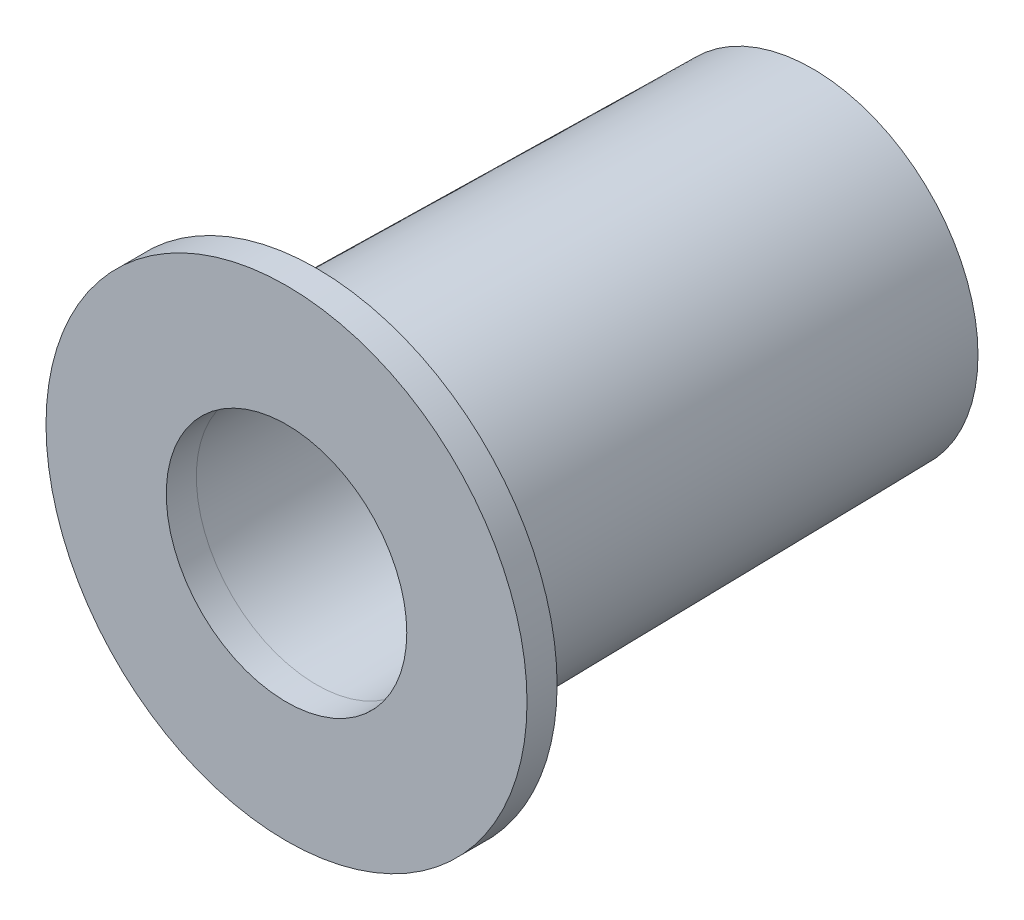
ISO-10303-21;
HEADER;
FILE_DESCRIPTION(('STEP AP214'),'2;1');
FILE_NAME('part.step','',(''),(''),'','','');
FILE_SCHEMA(('AUTOMOTIVE_DESIGN { 1 0 10303 214 1 1 1 1 }'));
ENDSEC;
DATA;
#1=APPLICATION_CONTEXT('core data for automotive mechanical design processes');
#2=APPLICATION_PROTOCOL_DEFINITION('international standard','automotive_design',2000,#1);
#3=PRODUCT_CONTEXT('',#1,'mechanical');
#4=PRODUCT('Part','Part','',(#3));
#5=PRODUCT_RELATED_PRODUCT_CATEGORY('part','',(#4));
#6=PRODUCT_DEFINITION_FORMATION('','',#4);
#7=PRODUCT_DEFINITION_CONTEXT('part definition',#1,'design');
#8=PRODUCT_DEFINITION('design','',#6,#7);
#9=PRODUCT_DEFINITION_SHAPE('','',#8);
#10=(LENGTH_UNIT() NAMED_UNIT(*) SI_UNIT(.MILLI.,.METRE.));
#11=(NAMED_UNIT(*) PLANE_ANGLE_UNIT() SI_UNIT($,.RADIAN.));
#12=(NAMED_UNIT(*) SI_UNIT($,.STERADIAN.) SOLID_ANGLE_UNIT());
#13=UNCERTAINTY_MEASURE_WITH_UNIT(LENGTH_MEASURE(1.E-05),#10,'distance_accuracy_value','');
#14=(GEOMETRIC_REPRESENTATION_CONTEXT(3) GLOBAL_UNCERTAINTY_ASSIGNED_CONTEXT((#13)) GLOBAL_UNIT_ASSIGNED_CONTEXT((#10,
#11,#12)) REPRESENTATION_CONTEXT('',''));
#15=CARTESIAN_POINT('',(0.,0.,0.));
#16=DIRECTION('',(0.,0.,1.));
#17=DIRECTION('',(1.,0.,0.));
#18=AXIS2_PLACEMENT_3D('',#15,#16,#17);
#19=CARTESIAN_POINT('',(0.,0.,0.));
#20=DIRECTION('',(0.,0.,1.));
#21=DIRECTION('',(1.,0.,0.));
#22=AXIS2_PLACEMENT_3D('',#19,#20,#21);
#23=PLANE('',#22);
#24=CARTESIAN_POINT('',(0.,0.,0.));
#25=DIRECTION('',(0.,0.,-1.));
#26=DIRECTION('',(-1.,0.,0.));
#27=AXIS2_PLACEMENT_3D('',#24,#25,#26);
#28=CIRCLE('',#27,7.5);
#29=CARTESIAN_POINT('',(-7.5,0.,0.));
#30=VERTEX_POINT('',#29);
#31=EDGE_CURVE('E51',#30,#30,#28,.T.);
#32=ORIENTED_EDGE('',*,*,#31,.F.);
#33=EDGE_LOOP('',(#32));
#34=FACE_BOUND('',#33,.T.);
#35=CARTESIAN_POINT('',(0.,0.,0.));
#36=DIRECTION('',(0.,0.,1.));
#37=DIRECTION('',(1.,0.,0.));
#38=AXIS2_PLACEMENT_3D('',#35,#36,#37);
#39=CIRCLE('',#38,11.);
#40=CARTESIAN_POINT('',(11.,0.,0.));
#41=VERTEX_POINT('',#40);
#42=EDGE_CURVE('E47',#41,#41,#39,.T.);
#43=ORIENTED_EDGE('',*,*,#42,.F.);
#44=EDGE_LOOP('',(#43));
#45=FACE_BOUND('',#44,.T.);
#46=ADVANCED_FACE('F39',(#34,#45),#23,.F.);
#47=CARTESIAN_POINT('',(0.,0.,0.));
#48=DIRECTION('',(0.,0.,1.));
#49=DIRECTION('',(1.,0.,0.));
#50=AXIS2_PLACEMENT_3D('',#47,#48,#49);
#51=CONICAL_SURFACE('',#50,11.,0.0151503558747698);
#52=ORIENTED_EDGE('',*,*,#42,.T.);
#53=EDGE_LOOP('',(#52));
#54=FACE_BOUND('',#53,.T.);
#55=CARTESIAN_POINT('',(0.,0.,33.));
#56=DIRECTION('',(0.,0.,1.));
#57=DIRECTION('',(1.,0.,0.));
#58=AXIS2_PLACEMENT_3D('',#55,#56,#57);
#59=CIRCLE('',#58,11.5);
#60=CARTESIAN_POINT('',(11.5,0.,33.));
#61=VERTEX_POINT('',#60);
#62=EDGE_CURVE('E11',#61,#61,#59,.T.);
#63=ORIENTED_EDGE('',*,*,#62,.F.);
#64=EDGE_LOOP('',(#63));
#65=FACE_BOUND('',#64,.T.);
#66=ADVANCED_FACE('F41',(#54,#65),#51,.T.);
#67=CARTESIAN_POINT('',(0.,0.,0.));
#68=DIRECTION('',(0.,0.,1.));
#69=DIRECTION('',(1.,0.,0.));
#70=AXIS2_PLACEMENT_3D('',#67,#68,#69);
#71=CONICAL_SURFACE('',#70,7.5,0.0151503558747698);
#72=ORIENTED_EDGE('',*,*,#31,.T.);
#73=EDGE_LOOP('',(#72));
#74=FACE_BOUND('',#73,.T.);
#75=CARTESIAN_POINT('',(0.,0.,33.));
#76=DIRECTION('',(0.,0.,1.));
#77=DIRECTION('',(1.,0.,0.));
#78=AXIS2_PLACEMENT_3D('',#75,#76,#77);
#79=CIRCLE('',#78,8.);
#80=CARTESIAN_POINT('',(8.,0.,33.));
#81=VERTEX_POINT('',#80);
#82=EDGE_CURVE('E101',#81,#81,#79,.T.);
#83=ORIENTED_EDGE('',*,*,#82,.T.);
#84=EDGE_LOOP('',(#83));
#85=FACE_BOUND('',#84,.T.);
#86=ADVANCED_FACE('F74',(#74,#85),#71,.F.);
#87=CARTESIAN_POINT('',(0.,0.,33.));
#88=DIRECTION('',(0.,0.,1.));
#89=DIRECTION('',(1.,0.,0.));
#90=AXIS2_PLACEMENT_3D('',#87,#88,#89);
#91=PLANE('',#90);
#92=CARTESIAN_POINT('',(0.,0.,33.));
#93=DIRECTION('',(0.,0.,1.));
#94=DIRECTION('',(1.,0.,0.));
#95=AXIS2_PLACEMENT_3D('',#92,#93,#94);
#96=CIRCLE('',#95,16.);
#97=CARTESIAN_POINT('',(16.,0.,33.));
#98=VERTEX_POINT('',#97);
#99=EDGE_CURVE('E104',#98,#98,#96,.T.);
#100=ORIENTED_EDGE('',*,*,#99,.F.);
#101=EDGE_LOOP('',(#100));
#102=FACE_BOUND('',#101,.T.);
#103=ORIENTED_EDGE('',*,*,#62,.T.);
#104=EDGE_LOOP('',(#103));
#105=FACE_BOUND('',#104,.T.);
#106=ADVANCED_FACE('F77',(#102,#105),#91,.F.);
#107=CARTESIAN_POINT('',(0.,0.,35.));
#108=DIRECTION('',(0.,0.,1.));
#109=DIRECTION('',(1.,0.,0.));
#110=AXIS2_PLACEMENT_3D('',#107,#108,#109);
#111=PLANE('',#110);
#112=CARTESIAN_POINT('',(0.,0.,35.));
#113=DIRECTION('',(0.,0.,1.));
#114=DIRECTION('',(1.,0.,0.));
#115=AXIS2_PLACEMENT_3D('',#112,#113,#114);
#116=CIRCLE('',#115,16.);
#117=CARTESIAN_POINT('',(16.,0.,35.));
#118=VERTEX_POINT('',#117);
#119=EDGE_CURVE('E57',#118,#118,#116,.T.);
#120=ORIENTED_EDGE('',*,*,#119,.T.);
#121=EDGE_LOOP('',(#120));
#122=FACE_BOUND('',#121,.T.);
#123=CARTESIAN_POINT('',(0.,0.,35.));
#124=DIRECTION('',(0.,0.,1.));
#125=DIRECTION('',(1.,0.,0.));
#126=AXIS2_PLACEMENT_3D('',#123,#124,#125);
#127=CIRCLE('',#126,8.);
#128=CARTESIAN_POINT('',(8.,0.,35.));
#129=VERTEX_POINT('',#128);
#130=EDGE_CURVE('E98',#129,#129,#127,.T.);
#131=ORIENTED_EDGE('',*,*,#130,.F.);
#132=EDGE_LOOP('',(#131));
#133=FACE_BOUND('',#132,.T.);
#134=ADVANCED_FACE('F83',(#122,#133),#111,.T.);
#135=CARTESIAN_POINT('',(0.,0.,35.));
#136=DIRECTION('',(0.,0.,-1.));
#137=DIRECTION('',(-1.,0.,0.));
#138=AXIS2_PLACEMENT_3D('',#135,#136,#137);
#139=CYLINDRICAL_SURFACE('',#138,16.);
#140=ORIENTED_EDGE('',*,*,#119,.F.);
#141=EDGE_LOOP('',(#140));
#142=FACE_BOUND('',#141,.T.);
#143=ORIENTED_EDGE('',*,*,#99,.T.);
#144=EDGE_LOOP('',(#143));
#145=FACE_BOUND('',#144,.T.);
#146=ADVANCED_FACE('F79',(#142,#145),#139,.T.);
#147=CARTESIAN_POINT('',(0.,0.,35.));
#148=DIRECTION('',(0.,0.,-1.));
#149=DIRECTION('',(-1.,0.,0.));
#150=AXIS2_PLACEMENT_3D('',#147,#148,#149);
#151=CYLINDRICAL_SURFACE('',#150,8.);
#152=ORIENTED_EDGE('',*,*,#130,.T.);
#153=EDGE_LOOP('',(#152));
#154=FACE_BOUND('',#153,.T.);
#155=ORIENTED_EDGE('',*,*,#82,.F.);
#156=EDGE_LOOP('',(#155));
#157=FACE_BOUND('',#156,.T.);
#158=ADVANCED_FACE('F82',(#154,#157),#151,.F.);
#159=CLOSED_SHELL('',(#46,#66,#86,#106,#134,#146,#158));
#160=MANIFOLD_SOLID_BREP('B2',#159);
#161=ADVANCED_BREP_SHAPE_REPRESENTATION('',(#18,#160),#14);
#162=SHAPE_DEFINITION_REPRESENTATION(#9,#161);
ENDSEC;
END-ISO-10303-21;
